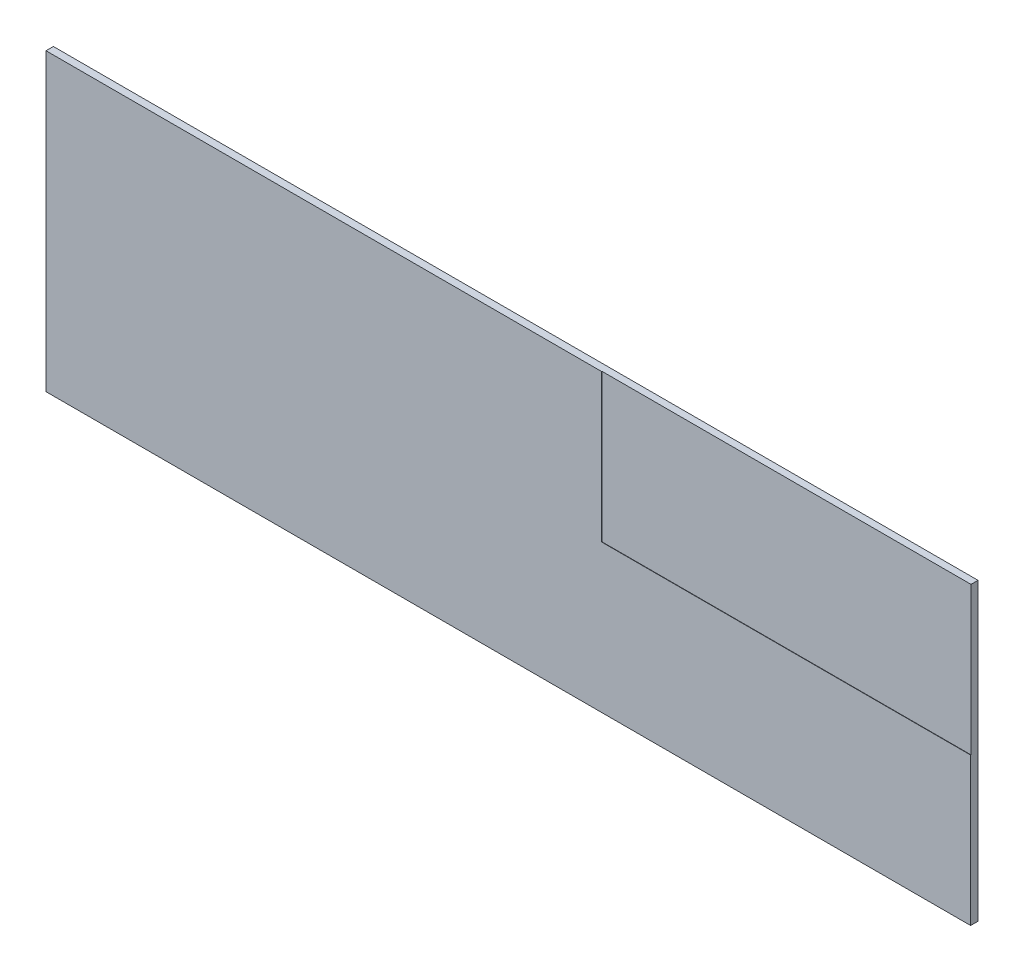
ISO-10303-21;
HEADER;
FILE_DESCRIPTION(('STEP AP214'),'2;1');
FILE_NAME('part.step','',(''),(''),'','','');
FILE_SCHEMA(('AUTOMOTIVE_DESIGN { 1 0 10303 214 1 1 1 1 }'));
ENDSEC;
DATA;
#1=APPLICATION_CONTEXT('core data for automotive mechanical design processes');
#2=APPLICATION_PROTOCOL_DEFINITION('international standard','automotive_design',2000,#1);
#3=PRODUCT_CONTEXT('',#1,'mechanical');
#4=PRODUCT('Part','Part','',(#3));
#5=PRODUCT_RELATED_PRODUCT_CATEGORY('part','',(#4));
#6=PRODUCT_DEFINITION_FORMATION('','',#4);
#7=PRODUCT_DEFINITION_CONTEXT('part definition',#1,'design');
#8=PRODUCT_DEFINITION('design','',#6,#7);
#9=PRODUCT_DEFINITION_SHAPE('','',#8);
#10=(LENGTH_UNIT() NAMED_UNIT(*) SI_UNIT(.MILLI.,.METRE.));
#11=(NAMED_UNIT(*) PLANE_ANGLE_UNIT() SI_UNIT($,.RADIAN.));
#12=(NAMED_UNIT(*) SI_UNIT($,.STERADIAN.) SOLID_ANGLE_UNIT());
#13=UNCERTAINTY_MEASURE_WITH_UNIT(LENGTH_MEASURE(1.E-05),#10,'distance_accuracy_value','');
#14=(GEOMETRIC_REPRESENTATION_CONTEXT(3) GLOBAL_UNCERTAINTY_ASSIGNED_CONTEXT((#13)) GLOBAL_UNIT_ASSIGNED_CONTEXT((#10,
#11,#12)) REPRESENTATION_CONTEXT('',''));
#15=CARTESIAN_POINT('',(0.,0.,0.));
#16=DIRECTION('',(0.,0.,1.));
#17=DIRECTION('',(1.,0.,0.));
#18=AXIS2_PLACEMENT_3D('',#15,#16,#17);
#19=CARTESIAN_POINT('',(12525.,-4000.,200.));
#20=DIRECTION('',(-1.,0.,0.));
#21=DIRECTION('',(0.,0.,1.));
#22=AXIS2_PLACEMENT_3D('',#19,#20,#21);
#23=PLANE('',#22);
#24=DIRECTION('',(0.,1.,0.));
#25=VECTOR('',#24,1.);
#26=CARTESIAN_POINT('',(12525.,4000.,190.));
#27=LINE('',#26,#25);
#28=CARTESIAN_POINT('',(12525.,0.,190.));
#29=VERTEX_POINT('',#28);
#30=CARTESIAN_POINT('',(12525.,4000.,190.));
#31=VERTEX_POINT('',#30);
#32=EDGE_CURVE('E112',#29,#31,#27,.T.);
#33=ORIENTED_EDGE('',*,*,#32,.F.);
#34=DIRECTION('',(0.,0.,1.));
#35=VECTOR('',#34,1.);
#36=CARTESIAN_POINT('',(12525.,0.,190.));
#37=LINE('',#36,#35);
#38=CARTESIAN_POINT('',(12525.,0.,200.));
#39=VERTEX_POINT('',#38);
#40=EDGE_CURVE('E119',#29,#39,#37,.T.);
#41=ORIENTED_EDGE('',*,*,#40,.T.);
#42=DIRECTION('',(0.,1.,0.));
#43=VECTOR('',#42,1.);
#44=CARTESIAN_POINT('',(12525.,-4000.,200.));
#45=LINE('',#44,#43);
#46=CARTESIAN_POINT('',(12525.,-4000.,200.));
#47=VERTEX_POINT('',#46);
#48=EDGE_CURVE('E124',#47,#39,#45,.T.);
#49=ORIENTED_EDGE('',*,*,#48,.F.);
#50=DIRECTION('',(0.,0.,-1.));
#51=VECTOR('',#50,1.);
#52=CARTESIAN_POINT('',(12525.,-4000.,200.));
#53=LINE('',#52,#51);
#54=CARTESIAN_POINT('',(12525.,-4000.,0.));
#55=VERTEX_POINT('',#54);
#56=EDGE_CURVE('E130',#47,#55,#53,.T.);
#57=ORIENTED_EDGE('',*,*,#56,.T.);
#58=DIRECTION('',(0.,1.,0.));
#59=VECTOR('',#58,1.);
#60=CARTESIAN_POINT('',(12525.,-4000.,0.));
#61=LINE('',#60,#59);
#62=CARTESIAN_POINT('',(12525.,4000.,0.));
#63=VERTEX_POINT('',#62);
#64=EDGE_CURVE('E131',#55,#63,#61,.T.);
#65=ORIENTED_EDGE('',*,*,#64,.T.);
#66=DIRECTION('',(0.,0.,-1.));
#67=VECTOR('',#66,1.);
#68=CARTESIAN_POINT('',(12525.,4000.,200.));
#69=LINE('',#68,#67);
#70=EDGE_CURVE('E11',#31,#63,#69,.T.);
#71=ORIENTED_EDGE('',*,*,#70,.F.);
#72=EDGE_LOOP('',(#33,#41,#49,#57,#65,#71));
#73=FACE_BOUND('',#72,.T.);
#74=ADVANCED_FACE('F34',(#73),#23,.F.);
#75=CARTESIAN_POINT('',(-12525.,4000.,200.));
#76=DIRECTION('',(0.,-1.,0.));
#77=DIRECTION('',(0.,0.,-1.));
#78=AXIS2_PLACEMENT_3D('',#75,#76,#77);
#79=PLANE('',#78);
#80=DIRECTION('',(-1.,0.,0.));
#81=VECTOR('',#80,1.);
#82=CARTESIAN_POINT('',(-12525.,4000.,200.));
#83=LINE('',#82,#81);
#84=CARTESIAN_POINT('',(2524.99999999999,4000.,200.));
#85=VERTEX_POINT('',#84);
#86=CARTESIAN_POINT('',(-12525.,4000.,200.));
#87=VERTEX_POINT('',#86);
#88=EDGE_CURVE('E80',#85,#87,#83,.T.);
#89=ORIENTED_EDGE('',*,*,#88,.F.);
#90=DIRECTION('',(0.,0.,1.));
#91=VECTOR('',#90,1.);
#92=CARTESIAN_POINT('',(2524.99999999999,4000.,190.));
#93=LINE('',#92,#91);
#94=CARTESIAN_POINT('',(2524.99999999999,4000.,190.));
#95=VERTEX_POINT('',#94);
#96=EDGE_CURVE('E48',#95,#85,#93,.T.);
#97=ORIENTED_EDGE('',*,*,#96,.F.);
#98=DIRECTION('',(-1.,0.,0.));
#99=VECTOR('',#98,1.);
#100=CARTESIAN_POINT('',(12525.,4000.,190.));
#101=LINE('',#100,#99);
#102=EDGE_CURVE('E107',#31,#95,#101,.T.);
#103=ORIENTED_EDGE('',*,*,#102,.F.);
#104=ORIENTED_EDGE('',*,*,#70,.T.);
#105=DIRECTION('',(-1.,0.,0.));
#106=VECTOR('',#105,1.);
#107=CARTESIAN_POINT('',(-12525.,4000.,0.));
#108=LINE('',#107,#106);
#109=CARTESIAN_POINT('',(-12525.,4000.,0.));
#110=VERTEX_POINT('',#109);
#111=EDGE_CURVE('E134',#63,#110,#108,.T.);
#112=ORIENTED_EDGE('',*,*,#111,.T.);
#113=DIRECTION('',(0.,0.,-1.));
#114=VECTOR('',#113,1.);
#115=CARTESIAN_POINT('',(-12525.,4000.,200.));
#116=LINE('',#115,#114);
#117=EDGE_CURVE('E41',#87,#110,#116,.T.);
#118=ORIENTED_EDGE('',*,*,#117,.F.);
#119=EDGE_LOOP('',(#89,#97,#103,#104,#112,#118));
#120=FACE_BOUND('',#119,.T.);
#121=ADVANCED_FACE('F117',(#120),#79,.F.);
#122=CARTESIAN_POINT('',(-12525.,-4000.,200.));
#123=DIRECTION('',(1.,0.,0.));
#124=DIRECTION('',(0.,0.,-1.));
#125=AXIS2_PLACEMENT_3D('',#122,#123,#124);
#126=PLANE('',#125);
#127=DIRECTION('',(0.,-1.,0.));
#128=VECTOR('',#127,1.);
#129=CARTESIAN_POINT('',(-12525.,-4000.,0.));
#130=LINE('',#129,#128);
#131=CARTESIAN_POINT('',(-12525.,-4000.,0.));
#132=VERTEX_POINT('',#131);
#133=EDGE_CURVE('E136',#110,#132,#130,.T.);
#134=ORIENTED_EDGE('',*,*,#133,.T.);
#135=DIRECTION('',(0.,0.,-1.));
#136=VECTOR('',#135,1.);
#137=CARTESIAN_POINT('',(-12525.,-4000.,200.));
#138=LINE('',#137,#136);
#139=CARTESIAN_POINT('',(-12525.,-4000.,200.));
#140=VERTEX_POINT('',#139);
#141=EDGE_CURVE('E140',#140,#132,#138,.T.);
#142=ORIENTED_EDGE('',*,*,#141,.F.);
#143=DIRECTION('',(0.,-1.,0.));
#144=VECTOR('',#143,1.);
#145=CARTESIAN_POINT('',(-12525.,-4000.,200.));
#146=LINE('',#145,#144);
#147=EDGE_CURVE('E127',#87,#140,#146,.T.);
#148=ORIENTED_EDGE('',*,*,#147,.F.);
#149=ORIENTED_EDGE('',*,*,#117,.T.);
#150=EDGE_LOOP('',(#134,#142,#148,#149));
#151=FACE_BOUND('',#150,.T.);
#152=ADVANCED_FACE('F145',(#151),#126,.F.);
#153=CARTESIAN_POINT('',(-12525.,-4000.,200.));
#154=DIRECTION('',(0.,1.,0.));
#155=DIRECTION('',(0.,0.,1.));
#156=AXIS2_PLACEMENT_3D('',#153,#154,#155);
#157=PLANE('',#156);
#158=DIRECTION('',(1.,0.,0.));
#159=VECTOR('',#158,1.);
#160=CARTESIAN_POINT('',(-12525.,-4000.,0.));
#161=LINE('',#160,#159);
#162=EDGE_CURVE('E76',#132,#55,#161,.T.);
#163=ORIENTED_EDGE('',*,*,#162,.T.);
#164=ORIENTED_EDGE('',*,*,#56,.F.);
#165=DIRECTION('',(1.,0.,0.));
#166=VECTOR('',#165,1.);
#167=CARTESIAN_POINT('',(-12525.,-4000.,200.));
#168=LINE('',#167,#166);
#169=EDGE_CURVE('E57',#140,#47,#168,.T.);
#170=ORIENTED_EDGE('',*,*,#169,.F.);
#171=ORIENTED_EDGE('',*,*,#141,.T.);
#172=EDGE_LOOP('',(#163,#164,#170,#171));
#173=FACE_BOUND('',#172,.T.);
#174=ADVANCED_FACE('F154',(#173),#157,.F.);
#175=CARTESIAN_POINT('',(0.,0.,200.));
#176=DIRECTION('',(0.,0.,-1.));
#177=DIRECTION('',(-1.,0.,0.));
#178=AXIS2_PLACEMENT_3D('',#175,#176,#177);
#179=PLANE('',#178);
#180=ORIENTED_EDGE('',*,*,#48,.T.);
#181=DIRECTION('',(1.,0.,0.));
#182=VECTOR('',#181,1.);
#183=CARTESIAN_POINT('',(2524.99999999999,0.,200.));
#184=LINE('',#183,#182);
#185=CARTESIAN_POINT('',(2524.99999999999,0.,200.));
#186=VERTEX_POINT('',#185);
#187=EDGE_CURVE('E115',#186,#39,#184,.T.);
#188=ORIENTED_EDGE('',*,*,#187,.F.);
#189=DIRECTION('',(0.,-1.,0.));
#190=VECTOR('',#189,1.);
#191=CARTESIAN_POINT('',(2524.99999999999,4000.,200.));
#192=LINE('',#191,#190);
#193=EDGE_CURVE('E244',#85,#186,#192,.T.);
#194=ORIENTED_EDGE('',*,*,#193,.F.);
#195=ORIENTED_EDGE('',*,*,#88,.T.);
#196=ORIENTED_EDGE('',*,*,#147,.T.);
#197=ORIENTED_EDGE('',*,*,#169,.T.);
#198=EDGE_LOOP('',(#180,#188,#194,#195,#196,#197));
#199=FACE_BOUND('',#198,.T.);
#200=ADVANCED_FACE('F156',(#199),#179,.F.);
#201=CARTESIAN_POINT('',(0.,0.,0.));
#202=DIRECTION('',(0.,0.,-1.));
#203=DIRECTION('',(-1.,0.,0.));
#204=AXIS2_PLACEMENT_3D('',#201,#202,#203);
#205=PLANE('',#204);
#206=ORIENTED_EDGE('',*,*,#64,.F.);
#207=ORIENTED_EDGE('',*,*,#162,.F.);
#208=ORIENTED_EDGE('',*,*,#133,.F.);
#209=ORIENTED_EDGE('',*,*,#111,.F.);
#210=EDGE_LOOP('',(#206,#207,#208,#209));
#211=FACE_BOUND('',#210,.T.);
#212=ADVANCED_FACE('F150',(#211),#205,.T.);
#213=CARTESIAN_POINT('',(2524.99999999999,0.,190.));
#214=DIRECTION('',(0.,-1.,0.));
#215=DIRECTION('',(0.,0.,-1.));
#216=AXIS2_PLACEMENT_3D('',#213,#214,#215);
#217=PLANE('',#216);
#218=ORIENTED_EDGE('',*,*,#187,.T.);
#219=ORIENTED_EDGE('',*,*,#40,.F.);
#220=DIRECTION('',(1.,0.,0.));
#221=VECTOR('',#220,1.);
#222=CARTESIAN_POINT('',(2524.99999999999,0.,190.));
#223=LINE('',#222,#221);
#224=CARTESIAN_POINT('',(2524.99999999999,0.,190.));
#225=VERTEX_POINT('',#224);
#226=EDGE_CURVE('E106',#225,#29,#223,.T.);
#227=ORIENTED_EDGE('',*,*,#226,.F.);
#228=DIRECTION('',(0.,0.,1.));
#229=VECTOR('',#228,1.);
#230=CARTESIAN_POINT('',(2524.99999999999,0.,190.));
#231=LINE('',#230,#229);
#232=EDGE_CURVE('E102',#225,#186,#231,.T.);
#233=ORIENTED_EDGE('',*,*,#232,.T.);
#234=EDGE_LOOP('',(#218,#219,#227,#233));
#235=FACE_BOUND('',#234,.T.);
#236=ADVANCED_FACE('F189',(#235),#217,.F.);
#237=CARTESIAN_POINT('',(2524.99999999999,4000.,190.));
#238=DIRECTION('',(-1.,0.,0.));
#239=DIRECTION('',(0.,0.,1.));
#240=AXIS2_PLACEMENT_3D('',#237,#238,#239);
#241=PLANE('',#240);
#242=ORIENTED_EDGE('',*,*,#193,.T.);
#243=ORIENTED_EDGE('',*,*,#232,.F.);
#244=DIRECTION('',(0.,-1.,0.));
#245=VECTOR('',#244,1.);
#246=CARTESIAN_POINT('',(2524.99999999999,4000.,190.));
#247=LINE('',#246,#245);
#248=EDGE_CURVE('E99',#95,#225,#247,.T.);
#249=ORIENTED_EDGE('',*,*,#248,.F.);
#250=ORIENTED_EDGE('',*,*,#96,.T.);
#251=EDGE_LOOP('',(#242,#243,#249,#250));
#252=FACE_BOUND('',#251,.T.);
#253=ADVANCED_FACE('F101',(#252),#241,.F.);
#254=CARTESIAN_POINT('',(0.,0.,190.));
#255=DIRECTION('',(0.,0.,1.));
#256=DIRECTION('',(1.,0.,0.));
#257=AXIS2_PLACEMENT_3D('',#254,#255,#256);
#258=PLANE('',#257);
#259=ORIENTED_EDGE('',*,*,#102,.T.);
#260=ORIENTED_EDGE('',*,*,#248,.T.);
#261=ORIENTED_EDGE('',*,*,#226,.T.);
#262=ORIENTED_EDGE('',*,*,#32,.T.);
#263=EDGE_LOOP('',(#259,#260,#261,#262));
#264=FACE_BOUND('',#263,.T.);
#265=ADVANCED_FACE('F110',(#264),#258,.T.);
#266=CLOSED_SHELL('',(#74,#121,#152,#174,#200,#212,#236,#253,#265));
#267=MANIFOLD_SOLID_BREP('B2',#266);
#268=ADVANCED_BREP_SHAPE_REPRESENTATION('',(#18,#267),#14);
#269=SHAPE_DEFINITION_REPRESENTATION(#9,#268);
ENDSEC;
END-ISO-10303-21;
